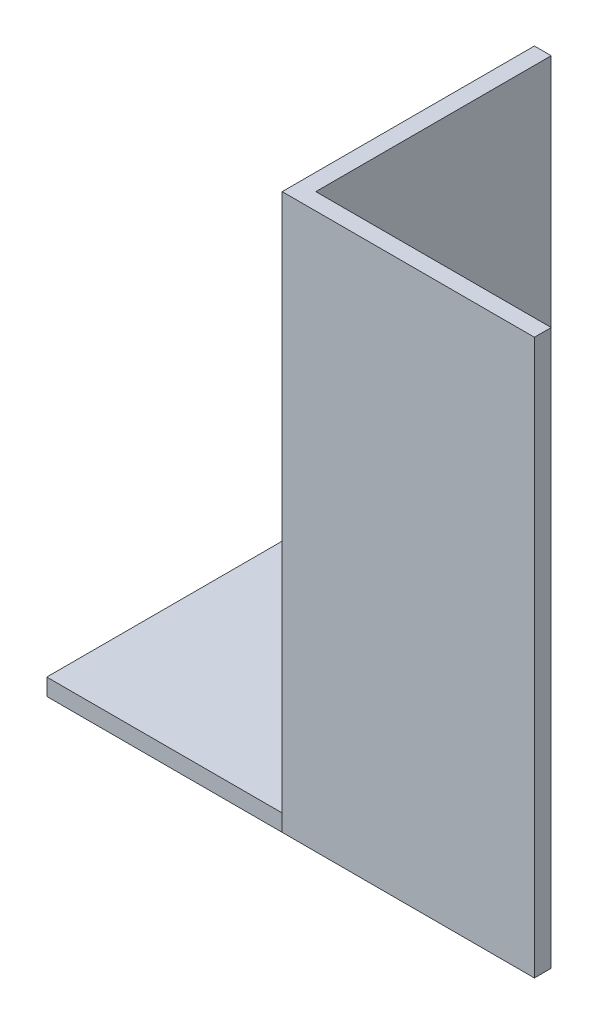
ISO-10303-21;
HEADER;
FILE_DESCRIPTION(('STEP AP214'),'2;1');
FILE_NAME('part.step','',(''),(''),'','','');
FILE_SCHEMA(('AUTOMOTIVE_DESIGN { 1 0 10303 214 1 1 1 1 }'));
ENDSEC;
DATA;
#1=APPLICATION_CONTEXT('core data for automotive mechanical design processes');
#2=APPLICATION_PROTOCOL_DEFINITION('international standard','automotive_design',2000,#1);
#3=PRODUCT_CONTEXT('',#1,'mechanical');
#4=PRODUCT('Part','Part','',(#3));
#5=PRODUCT_RELATED_PRODUCT_CATEGORY('part','',(#4));
#6=PRODUCT_DEFINITION_FORMATION('','',#4);
#7=PRODUCT_DEFINITION_CONTEXT('part definition',#1,'design');
#8=PRODUCT_DEFINITION('design','',#6,#7);
#9=PRODUCT_DEFINITION_SHAPE('','',#8);
#10=(LENGTH_UNIT() NAMED_UNIT(*) SI_UNIT(.MILLI.,.METRE.));
#11=(NAMED_UNIT(*) PLANE_ANGLE_UNIT() SI_UNIT($,.RADIAN.));
#12=(NAMED_UNIT(*) SI_UNIT($,.STERADIAN.) SOLID_ANGLE_UNIT());
#13=UNCERTAINTY_MEASURE_WITH_UNIT(LENGTH_MEASURE(1.E-05),#10,'distance_accuracy_value','');
#14=(GEOMETRIC_REPRESENTATION_CONTEXT(3) GLOBAL_UNCERTAINTY_ASSIGNED_CONTEXT((#13)) GLOBAL_UNIT_ASSIGNED_CONTEXT((#10,
#11,#12)) REPRESENTATION_CONTEXT('',''));
#15=CARTESIAN_POINT('',(0.,0.,0.));
#16=DIRECTION('',(0.,0.,1.));
#17=DIRECTION('',(1.,0.,0.));
#18=AXIS2_PLACEMENT_3D('',#15,#16,#17);
#19=CARTESIAN_POINT('',(0.,20.,0.));
#20=DIRECTION('',(0.,-1.,0.));
#21=DIRECTION('',(0.,0.,-1.));
#22=AXIS2_PLACEMENT_3D('',#19,#20,#21);
#23=PLANE('',#22);
#24=DIRECTION('',(0.,0.,-1.));
#25=VECTOR('',#24,1.);
#26=CARTESIAN_POINT('',(0.,20.,0.));
#27=LINE('',#26,#25);
#28=CARTESIAN_POINT('',(0.,20.,0.));
#29=VERTEX_POINT('',#28);
#30=CARTESIAN_POINT('',(0.,20.,-0.999999999999997));
#31=VERTEX_POINT('',#30);
#32=EDGE_CURVE('E153',#29,#31,#27,.T.);
#33=ORIENTED_EDGE('',*,*,#32,.T.);
#34=DIRECTION('',(1.,0.,0.));
#35=VECTOR('',#34,1.);
#36=CARTESIAN_POINT('',(-15.,20.,-0.999999999999995));
#37=LINE('',#36,#35);
#38=CARTESIAN_POINT('',(1.,20.,-0.999999999999997));
#39=VERTEX_POINT('',#38);
#40=EDGE_CURVE('E11',#31,#39,#37,.T.);
#41=ORIENTED_EDGE('',*,*,#40,.T.);
#42=DIRECTION('',(1.,0.,0.));
#43=VECTOR('',#42,1.);
#44=CARTESIAN_POINT('',(1.,20.,-0.999999999999997));
#45=LINE('',#44,#43);
#46=CARTESIAN_POINT('',(15.,20.,-0.999999999999998));
#47=VERTEX_POINT('',#46);
#48=EDGE_CURVE('E156',#39,#47,#45,.T.);
#49=ORIENTED_EDGE('',*,*,#48,.T.);
#50=DIRECTION('',(0.,0.,1.));
#51=VECTOR('',#50,1.);
#52=CARTESIAN_POINT('',(15.,20.,-0.999999999999998));
#53=LINE('',#52,#51);
#54=CARTESIAN_POINT('',(15.,20.,0.));
#55=VERTEX_POINT('',#54);
#56=EDGE_CURVE('E143',#47,#55,#53,.T.);
#57=ORIENTED_EDGE('',*,*,#56,.T.);
#58=DIRECTION('',(-1.,0.,0.));
#59=VECTOR('',#58,1.);
#60=CARTESIAN_POINT('',(15.,20.,0.));
#61=LINE('',#60,#59);
#62=EDGE_CURVE('E53',#55,#29,#61,.T.);
#63=ORIENTED_EDGE('',*,*,#62,.T.);
#64=EDGE_LOOP('',(#33,#41,#49,#57,#63));
#65=FACE_BOUND('',#64,.T.);
#66=ADVANCED_FACE('F35',(#65),#23,.T.);
#67=CARTESIAN_POINT('',(15.,53.,0.));
#68=DIRECTION('',(0.,0.,-1.));
#69=DIRECTION('',(-1.,0.,0.));
#70=AXIS2_PLACEMENT_3D('',#67,#68,#69);
#71=PLANE('',#70);
#72=ORIENTED_EDGE('',*,*,#62,.F.);
#73=DIRECTION('',(0.,-1.,0.));
#74=VECTOR('',#73,1.);
#75=CARTESIAN_POINT('',(15.,53.,0.));
#76=LINE('',#75,#74);
#77=CARTESIAN_POINT('',(15.,53.,0.));
#78=VERTEX_POINT('',#77);
#79=EDGE_CURVE('E44',#78,#55,#76,.T.);
#80=ORIENTED_EDGE('',*,*,#79,.F.);
#81=DIRECTION('',(1.,0.,0.));
#82=VECTOR('',#81,1.);
#83=CARTESIAN_POINT('',(15.,53.,0.));
#84=LINE('',#83,#82);
#85=CARTESIAN_POINT('',(0.,53.,0.));
#86=VERTEX_POINT('',#85);
#87=EDGE_CURVE('E191',#86,#78,#84,.T.);
#88=ORIENTED_EDGE('',*,*,#87,.F.);
#89=DIRECTION('',(0.,-1.,0.));
#90=VECTOR('',#89,1.);
#91=CARTESIAN_POINT('',(0.,53.,0.));
#92=LINE('',#91,#90);
#93=EDGE_CURVE('E164',#86,#29,#92,.T.);
#94=ORIENTED_EDGE('',*,*,#93,.T.);
#95=EDGE_LOOP('',(#72,#80,#88,#94));
#96=FACE_BOUND('',#95,.T.);
#97=ADVANCED_FACE('F37',(#96),#71,.F.);
#98=CARTESIAN_POINT('',(15.,53.,-0.999999999999998));
#99=DIRECTION('',(-1.,0.,0.));
#100=DIRECTION('',(0.,0.,1.));
#101=AXIS2_PLACEMENT_3D('',#98,#99,#100);
#102=PLANE('',#101);
#103=ORIENTED_EDGE('',*,*,#56,.F.);
#104=DIRECTION('',(0.,-1.,0.));
#105=VECTOR('',#104,1.);
#106=CARTESIAN_POINT('',(15.,53.,-0.999999999999998));
#107=LINE('',#106,#105);
#108=CARTESIAN_POINT('',(15.,53.,-0.999999999999998));
#109=VERTEX_POINT('',#108);
#110=EDGE_CURVE('E179',#109,#47,#107,.T.);
#111=ORIENTED_EDGE('',*,*,#110,.F.);
#112=DIRECTION('',(0.,0.,-1.));
#113=VECTOR('',#112,1.);
#114=CARTESIAN_POINT('',(15.,53.,-0.999999999999998));
#115=LINE('',#114,#113);
#116=EDGE_CURVE('E190',#78,#109,#115,.T.);
#117=ORIENTED_EDGE('',*,*,#116,.F.);
#118=ORIENTED_EDGE('',*,*,#79,.T.);
#119=EDGE_LOOP('',(#103,#111,#117,#118));
#120=FACE_BOUND('',#119,.T.);
#121=ADVANCED_FACE('F189',(#120),#102,.F.);
#122=CARTESIAN_POINT('',(1.,53.,-0.999999999999997));
#123=DIRECTION('',(0.,0.,1.));
#124=DIRECTION('',(1.,0.,0.));
#125=AXIS2_PLACEMENT_3D('',#122,#123,#124);
#126=PLANE('',#125);
#127=ORIENTED_EDGE('',*,*,#48,.F.);
#128=DIRECTION('',(0.,-1.,0.));
#129=VECTOR('',#128,1.);
#130=CARTESIAN_POINT('',(1.,53.,-0.999999999999997));
#131=LINE('',#130,#129);
#132=CARTESIAN_POINT('',(1.,53.,-0.999999999999997));
#133=VERTEX_POINT('',#132);
#134=EDGE_CURVE('E168',#133,#39,#131,.T.);
#135=ORIENTED_EDGE('',*,*,#134,.F.);
#136=DIRECTION('',(-1.,0.,0.));
#137=VECTOR('',#136,1.);
#138=CARTESIAN_POINT('',(1.,53.,-0.999999999999997));
#139=LINE('',#138,#137);
#140=EDGE_CURVE('E192',#109,#133,#139,.T.);
#141=ORIENTED_EDGE('',*,*,#140,.F.);
#142=ORIENTED_EDGE('',*,*,#110,.T.);
#143=EDGE_LOOP('',(#127,#135,#141,#142));
#144=FACE_BOUND('',#143,.T.);
#145=ADVANCED_FACE('F205',(#144),#126,.F.);
#146=CARTESIAN_POINT('',(0.999999999999998,53.,-15.));
#147=DIRECTION('',(-1.,0.,0.));
#148=DIRECTION('',(0.,0.,1.));
#149=AXIS2_PLACEMENT_3D('',#146,#147,#148);
#150=PLANE('',#149);
#151=ORIENTED_EDGE('',*,*,#134,.T.);
#152=DIRECTION('',(0.,-1.,0.));
#153=VECTOR('',#152,1.);
#154=CARTESIAN_POINT('',(1.,20.,-0.999999999999997));
#155=LINE('',#154,#153);
#156=CARTESIAN_POINT('',(1.,19.,-0.999999999999997));
#157=VERTEX_POINT('',#156);
#158=EDGE_CURVE('E137',#39,#157,#155,.T.);
#159=ORIENTED_EDGE('',*,*,#158,.T.);
#160=DIRECTION('',(0.,0.,-1.));
#161=VECTOR('',#160,1.);
#162=CARTESIAN_POINT('',(1.,19.,-0.999999999999997));
#163=LINE('',#162,#161);
#164=CARTESIAN_POINT('',(0.999999999999998,19.,-15.));
#165=VERTEX_POINT('',#164);
#166=EDGE_CURVE('E117',#157,#165,#163,.T.);
#167=ORIENTED_EDGE('',*,*,#166,.T.);
#168=DIRECTION('',(0.,-1.,0.));
#169=VECTOR('',#168,1.);
#170=CARTESIAN_POINT('',(0.999999999999998,53.,-15.));
#171=LINE('',#170,#169);
#172=CARTESIAN_POINT('',(0.999999999999998,53.,-15.));
#173=VERTEX_POINT('',#172);
#174=EDGE_CURVE('E163',#173,#165,#171,.T.);
#175=ORIENTED_EDGE('',*,*,#174,.F.);
#176=DIRECTION('',(0.,0.,-1.));
#177=VECTOR('',#176,1.);
#178=CARTESIAN_POINT('',(0.999999999999998,53.,-15.));
#179=LINE('',#178,#177);
#180=EDGE_CURVE('E196',#133,#173,#179,.T.);
#181=ORIENTED_EDGE('',*,*,#180,.F.);
#182=EDGE_LOOP('',(#151,#159,#167,#175,#181));
#183=FACE_BOUND('',#182,.T.);
#184=ADVANCED_FACE('F207',(#183),#150,.F.);
#185=CARTESIAN_POINT('',(0.,53.,-15.));
#186=DIRECTION('',(0.,0.,1.));
#187=DIRECTION('',(1.,0.,0.));
#188=AXIS2_PLACEMENT_3D('',#185,#186,#187);
#189=PLANE('',#188);
#190=ORIENTED_EDGE('',*,*,#174,.T.);
#191=DIRECTION('',(1.,0.,0.));
#192=VECTOR('',#191,1.);
#193=CARTESIAN_POINT('',(-15.,19.,-15.));
#194=LINE('',#193,#192);
#195=CARTESIAN_POINT('',(-15.,19.,-15.));
#196=VERTEX_POINT('',#195);
#197=EDGE_CURVE('E121',#196,#165,#194,.T.);
#198=ORIENTED_EDGE('',*,*,#197,.F.);
#199=DIRECTION('',(0.,1.,0.));
#200=VECTOR('',#199,1.);
#201=CARTESIAN_POINT('',(-15.,20.,-15.));
#202=LINE('',#201,#200);
#203=CARTESIAN_POINT('',(-15.,20.,-15.));
#204=VERTEX_POINT('',#203);
#205=EDGE_CURVE('E132',#196,#204,#202,.T.);
#206=ORIENTED_EDGE('',*,*,#205,.T.);
#207=DIRECTION('',(1.,0.,0.));
#208=VECTOR('',#207,1.);
#209=CARTESIAN_POINT('',(-15.,20.,-15.));
#210=LINE('',#209,#208);
#211=CARTESIAN_POINT('',(0.,20.,-15.));
#212=VERTEX_POINT('',#211);
#213=EDGE_CURVE('E144',#204,#212,#210,.T.);
#214=ORIENTED_EDGE('',*,*,#213,.T.);
#215=DIRECTION('',(0.,-1.,0.));
#216=VECTOR('',#215,1.);
#217=CARTESIAN_POINT('',(0.,53.,-15.));
#218=LINE('',#217,#216);
#219=CARTESIAN_POINT('',(0.,53.,-15.));
#220=VERTEX_POINT('',#219);
#221=EDGE_CURVE('E161',#220,#212,#218,.T.);
#222=ORIENTED_EDGE('',*,*,#221,.F.);
#223=DIRECTION('',(-1.,0.,0.));
#224=VECTOR('',#223,1.);
#225=CARTESIAN_POINT('',(0.,53.,-15.));
#226=LINE('',#225,#224);
#227=EDGE_CURVE('E174',#173,#220,#226,.T.);
#228=ORIENTED_EDGE('',*,*,#227,.F.);
#229=EDGE_LOOP('',(#190,#198,#206,#214,#222,#228));
#230=FACE_BOUND('',#229,.T.);
#231=ADVANCED_FACE('F202',(#230),#189,.F.);
#232=CARTESIAN_POINT('',(0.,53.,0.));
#233=DIRECTION('',(1.,0.,0.));
#234=DIRECTION('',(0.,0.,-1.));
#235=AXIS2_PLACEMENT_3D('',#232,#233,#234);
#236=PLANE('',#235);
#237=ORIENTED_EDGE('',*,*,#32,.F.);
#238=ORIENTED_EDGE('',*,*,#93,.F.);
#239=DIRECTION('',(0.,0.,1.));
#240=VECTOR('',#239,1.);
#241=CARTESIAN_POINT('',(0.,53.,0.));
#242=LINE('',#241,#240);
#243=EDGE_CURVE('E61',#220,#86,#242,.T.);
#244=ORIENTED_EDGE('',*,*,#243,.F.);
#245=ORIENTED_EDGE('',*,*,#221,.T.);
#246=EDGE_CURVE('E152',#31,#212,#27,.T.);
#247=ORIENTED_EDGE('',*,*,#246,.F.);
#248=EDGE_LOOP('',(#237,#238,#244,#245,#247));
#249=FACE_BOUND('',#248,.T.);
#250=ADVANCED_FACE('F203',(#249),#236,.F.);
#251=CARTESIAN_POINT('',(0.,53.,0.));
#252=DIRECTION('',(0.,-1.,0.));
#253=DIRECTION('',(0.,0.,-1.));
#254=AXIS2_PLACEMENT_3D('',#251,#252,#253);
#255=PLANE('',#254);
#256=ORIENTED_EDGE('',*,*,#87,.T.);
#257=ORIENTED_EDGE('',*,*,#116,.T.);
#258=ORIENTED_EDGE('',*,*,#140,.T.);
#259=ORIENTED_EDGE('',*,*,#180,.T.);
#260=ORIENTED_EDGE('',*,*,#227,.T.);
#261=ORIENTED_EDGE('',*,*,#243,.T.);
#262=EDGE_LOOP('',(#256,#257,#258,#259,#260,#261));
#263=FACE_BOUND('',#262,.T.);
#264=ADVANCED_FACE('F198',(#263),#255,.F.);
#265=CARTESIAN_POINT('',(-15.,20.,-0.999999999999995));
#266=DIRECTION('',(0.,0.,1.));
#267=DIRECTION('',(1.,0.,0.));
#268=AXIS2_PLACEMENT_3D('',#265,#266,#267);
#269=PLANE('',#268);
#270=ORIENTED_EDGE('',*,*,#158,.F.);
#271=ORIENTED_EDGE('',*,*,#40,.F.);
#272=CARTESIAN_POINT('',(-15.,20.,-0.999999999999995));
#273=VERTEX_POINT('',#272);
#274=EDGE_CURVE('E46',#273,#31,#37,.T.);
#275=ORIENTED_EDGE('',*,*,#274,.F.);
#276=DIRECTION('',(0.,-1.,0.));
#277=VECTOR('',#276,1.);
#278=CARTESIAN_POINT('',(-15.,20.,-0.999999999999995));
#279=LINE('',#278,#277);
#280=CARTESIAN_POINT('',(-15.,19.,-0.999999999999995));
#281=VERTEX_POINT('',#280);
#282=EDGE_CURVE('E129',#273,#281,#279,.T.);
#283=ORIENTED_EDGE('',*,*,#282,.T.);
#284=DIRECTION('',(1.,0.,0.));
#285=VECTOR('',#284,1.);
#286=CARTESIAN_POINT('',(-15.,19.,-0.999999999999995));
#287=LINE('',#286,#285);
#288=EDGE_CURVE('E111',#281,#157,#287,.T.);
#289=ORIENTED_EDGE('',*,*,#288,.T.);
#290=EDGE_LOOP('',(#270,#271,#275,#283,#289));
#291=FACE_BOUND('',#290,.T.);
#292=ADVANCED_FACE('F134',(#291),#269,.T.);
#293=CARTESIAN_POINT('',(-15.,20.,-0.999999999999995));
#294=DIRECTION('',(0.,1.,0.));
#295=DIRECTION('',(0.,0.,1.));
#296=AXIS2_PLACEMENT_3D('',#293,#294,#295);
#297=PLANE('',#296);
#298=ORIENTED_EDGE('',*,*,#274,.T.);
#299=ORIENTED_EDGE('',*,*,#246,.T.);
#300=ORIENTED_EDGE('',*,*,#213,.F.);
#301=DIRECTION('',(0.,0.,1.));
#302=VECTOR('',#301,1.);
#303=CARTESIAN_POINT('',(-15.,20.,-0.999999999999995));
#304=LINE('',#303,#302);
#305=EDGE_CURVE('E122',#204,#273,#304,.T.);
#306=ORIENTED_EDGE('',*,*,#305,.T.);
#307=EDGE_LOOP('',(#298,#299,#300,#306));
#308=FACE_BOUND('',#307,.T.);
#309=ADVANCED_FACE('F209',(#308),#297,.T.);
#310=CARTESIAN_POINT('',(-15.,19.,-0.999999999999995));
#311=DIRECTION('',(0.,-1.,0.));
#312=DIRECTION('',(0.,0.,-1.));
#313=AXIS2_PLACEMENT_3D('',#310,#311,#312);
#314=PLANE('',#313);
#315=ORIENTED_EDGE('',*,*,#166,.F.);
#316=ORIENTED_EDGE('',*,*,#288,.F.);
#317=DIRECTION('',(0.,0.,-1.));
#318=VECTOR('',#317,1.);
#319=CARTESIAN_POINT('',(-15.,19.,-0.999999999999995));
#320=LINE('',#319,#318);
#321=EDGE_CURVE('E115',#281,#196,#320,.T.);
#322=ORIENTED_EDGE('',*,*,#321,.T.);
#323=ORIENTED_EDGE('',*,*,#197,.T.);
#324=EDGE_LOOP('',(#315,#316,#322,#323));
#325=FACE_BOUND('',#324,.T.);
#326=ADVANCED_FACE('F113',(#325),#314,.T.);
#327=CARTESIAN_POINT('',(-15.,0.,0.));
#328=DIRECTION('',(1.,0.,0.));
#329=DIRECTION('',(0.,0.,-1.));
#330=AXIS2_PLACEMENT_3D('',#327,#328,#329);
#331=PLANE('',#330);
#332=ORIENTED_EDGE('',*,*,#282,.F.);
#333=ORIENTED_EDGE('',*,*,#305,.F.);
#334=ORIENTED_EDGE('',*,*,#205,.F.);
#335=ORIENTED_EDGE('',*,*,#321,.F.);
#336=EDGE_LOOP('',(#332,#333,#334,#335));
#337=FACE_BOUND('',#336,.T.);
#338=ADVANCED_FACE('F127',(#337),#331,.F.);
#339=CLOSED_SHELL('',(#66,#97,#121,#145,#184,#231,#250,#264,#292,#309,#326,#338));
#340=MANIFOLD_SOLID_BREP('B2',#339);
#341=ADVANCED_BREP_SHAPE_REPRESENTATION('',(#18,#340),#14);
#342=SHAPE_DEFINITION_REPRESENTATION(#9,#341);
ENDSEC;
END-ISO-10303-21;
